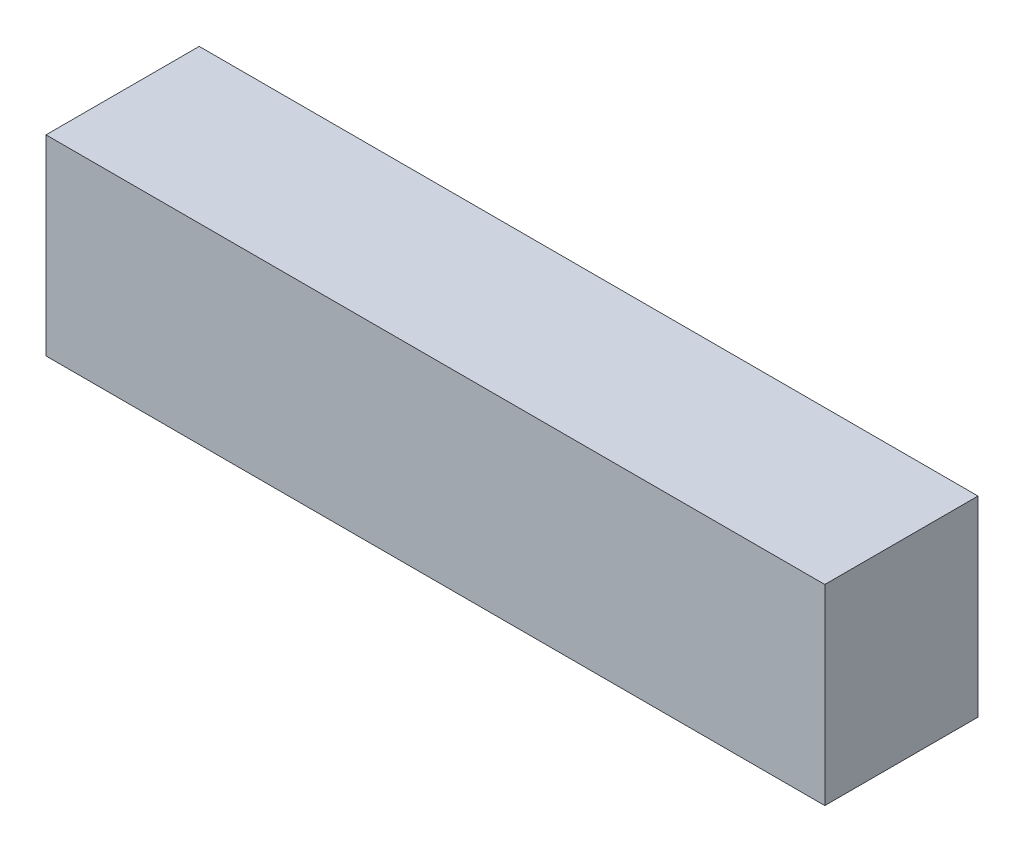
ISO-10303-21;
HEADER;
FILE_DESCRIPTION(('STEP AP214'),'2;1');
FILE_NAME('part.step','',(''),(''),'','','');
FILE_SCHEMA(('AUTOMOTIVE_DESIGN { 1 0 10303 214 1 1 1 1 }'));
ENDSEC;
DATA;
#1=APPLICATION_CONTEXT('core data for automotive mechanical design processes');
#2=APPLICATION_PROTOCOL_DEFINITION('international standard','automotive_design',2000,#1);
#3=PRODUCT_CONTEXT('',#1,'mechanical');
#4=PRODUCT('Part','Part','',(#3));
#5=PRODUCT_RELATED_PRODUCT_CATEGORY('part','',(#4));
#6=PRODUCT_DEFINITION_FORMATION('','',#4);
#7=PRODUCT_DEFINITION_CONTEXT('part definition',#1,'design');
#8=PRODUCT_DEFINITION('design','',#6,#7);
#9=PRODUCT_DEFINITION_SHAPE('','',#8);
#10=(LENGTH_UNIT() NAMED_UNIT(*) SI_UNIT(.MILLI.,.METRE.));
#11=(NAMED_UNIT(*) PLANE_ANGLE_UNIT() SI_UNIT($,.RADIAN.));
#12=(NAMED_UNIT(*) SI_UNIT($,.STERADIAN.) SOLID_ANGLE_UNIT());
#13=UNCERTAINTY_MEASURE_WITH_UNIT(LENGTH_MEASURE(1.E-05),#10,'distance_accuracy_value','');
#14=(GEOMETRIC_REPRESENTATION_CONTEXT(3) GLOBAL_UNCERTAINTY_ASSIGNED_CONTEXT((#13)) GLOBAL_UNIT_ASSIGNED_CONTEXT((#10,
#11,#12)) REPRESENTATION_CONTEXT('',''));
#15=CARTESIAN_POINT('',(0.,0.,0.));
#16=DIRECTION('',(0.,0.,1.));
#17=DIRECTION('',(1.,0.,0.));
#18=AXIS2_PLACEMENT_3D('',#15,#16,#17);
#19=CARTESIAN_POINT('',(0.,0.,12.));
#20=DIRECTION('',(1.,0.,0.));
#21=DIRECTION('',(0.,1.,0.));
#22=AXIS2_PLACEMENT_3D('',#19,#20,#21);
#23=PLANE('',#22);
#24=DIRECTION('',(0.,-1.,0.));
#25=VECTOR('',#24,1.);
#26=CARTESIAN_POINT('',(0.,0.,0.));
#27=LINE('',#26,#25);
#28=CARTESIAN_POINT('',(0.,0.,0.));
#29=VERTEX_POINT('',#28);
#30=CARTESIAN_POINT('',(0.,-15.,0.));
#31=VERTEX_POINT('',#30);
#32=EDGE_CURVE('E111',#29,#31,#27,.T.);
#33=ORIENTED_EDGE('',*,*,#32,.T.);
#34=DIRECTION('',(0.,0.,-1.));
#35=VECTOR('',#34,1.);
#36=CARTESIAN_POINT('',(0.,-15.,12.));
#37=LINE('',#36,#35);
#38=CARTESIAN_POINT('',(0.,-15.,12.));
#39=VERTEX_POINT('',#38);
#40=EDGE_CURVE('E11',#39,#31,#37,.T.);
#41=ORIENTED_EDGE('',*,*,#40,.F.);
#42=DIRECTION('',(0.,-1.,0.));
#43=VECTOR('',#42,1.);
#44=CARTESIAN_POINT('',(0.,0.,12.));
#45=LINE('',#44,#43);
#46=CARTESIAN_POINT('',(0.,0.,12.));
#47=VERTEX_POINT('',#46);
#48=EDGE_CURVE('E95',#47,#39,#45,.T.);
#49=ORIENTED_EDGE('',*,*,#48,.F.);
#50=DIRECTION('',(0.,0.,-1.));
#51=VECTOR('',#50,1.);
#52=CARTESIAN_POINT('',(0.,0.,12.));
#53=LINE('',#52,#51);
#54=EDGE_CURVE('E107',#47,#29,#53,.T.);
#55=ORIENTED_EDGE('',*,*,#54,.T.);
#56=EDGE_LOOP('',(#33,#41,#49,#55));
#57=FACE_BOUND('',#56,.T.);
#58=ADVANCED_FACE('F43',(#57),#23,.F.);
#59=CARTESIAN_POINT('',(0.,-15.,12.));
#60=DIRECTION('',(0.,1.,0.));
#61=DIRECTION('',(0.,0.,1.));
#62=AXIS2_PLACEMENT_3D('',#59,#60,#61);
#63=PLANE('',#62);
#64=DIRECTION('',(1.,0.,0.));
#65=VECTOR('',#64,1.);
#66=CARTESIAN_POINT('',(0.,-15.,0.));
#67=LINE('',#66,#65);
#68=CARTESIAN_POINT('',(61.,-15.,0.));
#69=VERTEX_POINT('',#68);
#70=EDGE_CURVE('E100',#31,#69,#67,.T.);
#71=ORIENTED_EDGE('',*,*,#70,.T.);
#72=DIRECTION('',(0.,0.,-1.));
#73=VECTOR('',#72,1.);
#74=CARTESIAN_POINT('',(61.,-15.,12.));
#75=LINE('',#74,#73);
#76=CARTESIAN_POINT('',(61.,-15.,12.));
#77=VERTEX_POINT('',#76);
#78=EDGE_CURVE('E52',#77,#69,#75,.T.);
#79=ORIENTED_EDGE('',*,*,#78,.F.);
#80=DIRECTION('',(1.,0.,0.));
#81=VECTOR('',#80,1.);
#82=CARTESIAN_POINT('',(0.,-15.,12.));
#83=LINE('',#82,#81);
#84=EDGE_CURVE('E90',#39,#77,#83,.T.);
#85=ORIENTED_EDGE('',*,*,#84,.F.);
#86=ORIENTED_EDGE('',*,*,#40,.T.);
#87=EDGE_LOOP('',(#71,#79,#85,#86));
#88=FACE_BOUND('',#87,.T.);
#89=ADVANCED_FACE('F99',(#88),#63,.F.);
#90=CARTESIAN_POINT('',(61.,0.,12.));
#91=DIRECTION('',(-1.,0.,0.));
#92=DIRECTION('',(0.,0.,1.));
#93=AXIS2_PLACEMENT_3D('',#90,#91,#92);
#94=PLANE('',#93);
#95=DIRECTION('',(0.,1.,0.));
#96=VECTOR('',#95,1.);
#97=CARTESIAN_POINT('',(61.,0.,0.));
#98=LINE('',#97,#96);
#99=CARTESIAN_POINT('',(61.,0.,0.));
#100=VERTEX_POINT('',#99);
#101=EDGE_CURVE('E77',#69,#100,#98,.T.);
#102=ORIENTED_EDGE('',*,*,#101,.T.);
#103=DIRECTION('',(0.,0.,-1.));
#104=VECTOR('',#103,1.);
#105=CARTESIAN_POINT('',(61.,0.,12.));
#106=LINE('',#105,#104);
#107=CARTESIAN_POINT('',(61.,0.,12.));
#108=VERTEX_POINT('',#107);
#109=EDGE_CURVE('E102',#108,#100,#106,.T.);
#110=ORIENTED_EDGE('',*,*,#109,.F.);
#111=DIRECTION('',(0.,1.,0.));
#112=VECTOR('',#111,1.);
#113=CARTESIAN_POINT('',(61.,0.,12.));
#114=LINE('',#113,#112);
#115=EDGE_CURVE('E93',#77,#108,#114,.T.);
#116=ORIENTED_EDGE('',*,*,#115,.F.);
#117=ORIENTED_EDGE('',*,*,#78,.T.);
#118=EDGE_LOOP('',(#102,#110,#116,#117));
#119=FACE_BOUND('',#118,.T.);
#120=ADVANCED_FACE('F103',(#119),#94,.F.);
#121=CARTESIAN_POINT('',(0.,0.,12.));
#122=DIRECTION('',(0.,-1.,0.));
#123=DIRECTION('',(0.,0.,-1.));
#124=AXIS2_PLACEMENT_3D('',#121,#122,#123);
#125=PLANE('',#124);
#126=DIRECTION('',(-1.,0.,0.));
#127=VECTOR('',#126,1.);
#128=CARTESIAN_POINT('',(0.,0.,0.));
#129=LINE('',#128,#127);
#130=EDGE_CURVE('E83',#100,#29,#129,.T.);
#131=ORIENTED_EDGE('',*,*,#130,.T.);
#132=ORIENTED_EDGE('',*,*,#54,.F.);
#133=DIRECTION('',(-1.,0.,0.));
#134=VECTOR('',#133,1.);
#135=CARTESIAN_POINT('',(0.,0.,12.));
#136=LINE('',#135,#134);
#137=EDGE_CURVE('E60',#108,#47,#136,.T.);
#138=ORIENTED_EDGE('',*,*,#137,.F.);
#139=ORIENTED_EDGE('',*,*,#109,.T.);
#140=EDGE_LOOP('',(#131,#132,#138,#139));
#141=FACE_BOUND('',#140,.T.);
#142=ADVANCED_FACE('F124',(#141),#125,.F.);
#143=CARTESIAN_POINT('',(0.,0.,12.));
#144=DIRECTION('',(0.,0.,1.));
#145=DIRECTION('',(1.,0.,0.));
#146=AXIS2_PLACEMENT_3D('',#143,#144,#145);
#147=PLANE('',#146);
#148=ORIENTED_EDGE('',*,*,#48,.T.);
#149=ORIENTED_EDGE('',*,*,#84,.T.);
#150=ORIENTED_EDGE('',*,*,#115,.T.);
#151=ORIENTED_EDGE('',*,*,#137,.T.);
#152=EDGE_LOOP('',(#148,#149,#150,#151));
#153=FACE_BOUND('',#152,.T.);
#154=ADVANCED_FACE('F91',(#153),#147,.T.);
#155=CARTESIAN_POINT('',(0.,0.,0.));
#156=DIRECTION('',(0.,0.,1.));
#157=DIRECTION('',(1.,0.,0.));
#158=AXIS2_PLACEMENT_3D('',#155,#156,#157);
#159=PLANE('',#158);
#160=ORIENTED_EDGE('',*,*,#32,.F.);
#161=ORIENTED_EDGE('',*,*,#130,.F.);
#162=ORIENTED_EDGE('',*,*,#101,.F.);
#163=ORIENTED_EDGE('',*,*,#70,.F.);
#164=EDGE_LOOP('',(#160,#161,#162,#163));
#165=FACE_BOUND('',#164,.T.);
#166=ADVANCED_FACE('F127',(#165),#159,.F.);
#167=CLOSED_SHELL('',(#58,#89,#120,#142,#154,#166));
#168=MANIFOLD_SOLID_BREP('B2',#167);
#169=ADVANCED_BREP_SHAPE_REPRESENTATION('',(#18,#168),#14);
#170=SHAPE_DEFINITION_REPRESENTATION(#9,#169);
ENDSEC;
END-ISO-10303-21;
